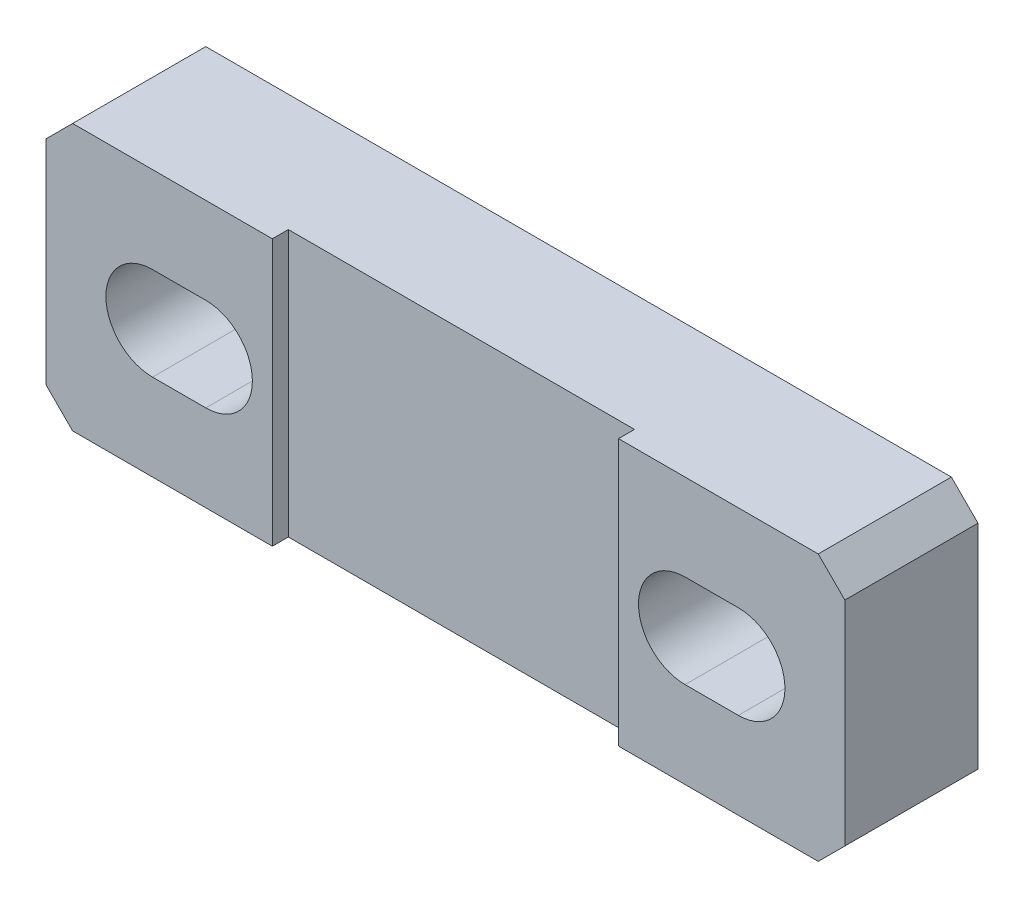
ISO-10303-21;
HEADER;
FILE_DESCRIPTION(('STEP AP214'),'2;1');
FILE_NAME('part.step','',(''),(''),'','','');
FILE_SCHEMA(('AUTOMOTIVE_DESIGN { 1 0 10303 214 1 1 1 1 }'));
ENDSEC;
DATA;
#1=APPLICATION_CONTEXT('core data for automotive mechanical design processes');
#2=APPLICATION_PROTOCOL_DEFINITION('international standard','automotive_design',2000,#1);
#3=PRODUCT_CONTEXT('',#1,'mechanical');
#4=PRODUCT('Part','Part','',(#3));
#5=PRODUCT_RELATED_PRODUCT_CATEGORY('part','',(#4));
#6=PRODUCT_DEFINITION_FORMATION('','',#4);
#7=PRODUCT_DEFINITION_CONTEXT('part definition',#1,'design');
#8=PRODUCT_DEFINITION('design','',#6,#7);
#9=PRODUCT_DEFINITION_SHAPE('','',#8);
#10=(LENGTH_UNIT() NAMED_UNIT(*) SI_UNIT(.MILLI.,.METRE.));
#11=(NAMED_UNIT(*) PLANE_ANGLE_UNIT() SI_UNIT($,.RADIAN.));
#12=(NAMED_UNIT(*) SI_UNIT($,.STERADIAN.) SOLID_ANGLE_UNIT());
#13=UNCERTAINTY_MEASURE_WITH_UNIT(LENGTH_MEASURE(1.E-05),#10,'distance_accuracy_value','');
#14=(GEOMETRIC_REPRESENTATION_CONTEXT(3) GLOBAL_UNCERTAINTY_ASSIGNED_CONTEXT((#13)) GLOBAL_UNIT_ASSIGNED_CONTEXT((#10,
#11,#12)) REPRESENTATION_CONTEXT('',''));
#15=CARTESIAN_POINT('',(0.,0.,0.));
#16=DIRECTION('',(0.,0.,1.));
#17=DIRECTION('',(1.,0.,0.));
#18=AXIS2_PLACEMENT_3D('',#15,#16,#17);
#19=CARTESIAN_POINT('',(0.,0.,0.));
#20=DIRECTION('',(0.,0.,1.));
#21=DIRECTION('',(1.,0.,0.));
#22=AXIS2_PLACEMENT_3D('',#19,#20,#21);
#23=PLANE('',#22);
#24=DIRECTION('',(0.,-1.,0.));
#25=VECTOR('',#24,1.);
#26=CARTESIAN_POINT('',(-15.,-5.,0.));
#27=LINE('',#26,#25);
#28=CARTESIAN_POINT('',(-15.,3.99999999999999,0.));
#29=VERTEX_POINT('',#28);
#30=CARTESIAN_POINT('',(-15.,-4.,0.));
#31=VERTEX_POINT('',#30);
#32=EDGE_CURVE('E254',#29,#31,#27,.T.);
#33=ORIENTED_EDGE('',*,*,#32,.T.);
#34=DIRECTION('',(-0.707106781186548,0.707106781186548,0.));
#35=VECTOR('',#34,1.);
#36=CARTESIAN_POINT('',(-9.5,-9.5,0.));
#37=LINE('',#36,#35);
#38=CARTESIAN_POINT('',(-14.,-5.,0.));
#39=VERTEX_POINT('',#38);
#40=EDGE_CURVE('E12',#31,#39,#37,.F.);
#41=ORIENTED_EDGE('',*,*,#40,.T.);
#42=DIRECTION('',(1.,0.,0.));
#43=VECTOR('',#42,1.);
#44=CARTESIAN_POINT('',(15.,-5.,0.));
#45=LINE('',#44,#43);
#46=CARTESIAN_POINT('',(-6.5,-5.,0.));
#47=VERTEX_POINT('',#46);
#48=EDGE_CURVE('E258',#39,#47,#45,.T.);
#49=ORIENTED_EDGE('',*,*,#48,.T.);
#50=DIRECTION('',(0.,-1.,0.));
#51=VECTOR('',#50,1.);
#52=CARTESIAN_POINT('',(-6.5,-5.,0.));
#53=LINE('',#52,#51);
#54=CARTESIAN_POINT('',(-6.5,5.,0.));
#55=VERTEX_POINT('',#54);
#56=EDGE_CURVE('E179',#55,#47,#53,.T.);
#57=ORIENTED_EDGE('',*,*,#56,.F.);
#58=DIRECTION('',(-1.,0.,0.));
#59=VECTOR('',#58,1.);
#60=CARTESIAN_POINT('',(15.,5.,0.));
#61=LINE('',#60,#59);
#62=CARTESIAN_POINT('',(-14.,4.99999999999999,0.));
#63=VERTEX_POINT('',#62);
#64=EDGE_CURVE('E263',#55,#63,#61,.T.);
#65=ORIENTED_EDGE('',*,*,#64,.T.);
#66=DIRECTION('',(0.707106781186544,0.707106781186551,0.));
#67=VECTOR('',#66,1.);
#68=CARTESIAN_POINT('',(-9.50000000000006,9.49999999999998,0.));
#69=LINE('',#68,#67);
#70=EDGE_CURVE('E45',#63,#29,#69,.F.);
#71=ORIENTED_EDGE('',*,*,#70,.T.);
#72=EDGE_LOOP('',(#33,#41,#49,#57,#65,#71));
#73=FACE_BOUND('',#72,.T.);
#74=CARTESIAN_POINT('',(-9.,0.,0.));
#75=DIRECTION('',(0.,0.,1.));
#76=DIRECTION('',(1.,0.,0.));
#77=AXIS2_PLACEMENT_3D('',#74,#75,#76);
#78=CIRCLE('',#77,1.75);
#79=CARTESIAN_POINT('',(-9.,-1.75,0.));
#80=VERTEX_POINT('',#79);
#81=CARTESIAN_POINT('',(-9.,1.75,0.));
#82=VERTEX_POINT('',#81);
#83=EDGE_CURVE('E427',#80,#82,#78,.T.);
#84=ORIENTED_EDGE('',*,*,#83,.F.);
#85=DIRECTION('',(1.,0.,0.));
#86=VECTOR('',#85,1.);
#87=CARTESIAN_POINT('',(-9.,-1.75,0.));
#88=LINE('',#87,#86);
#89=CARTESIAN_POINT('',(-11.,-1.75,0.));
#90=VERTEX_POINT('',#89);
#91=EDGE_CURVE('E417',#90,#80,#88,.T.);
#92=ORIENTED_EDGE('',*,*,#91,.F.);
#93=CARTESIAN_POINT('',(-11.,0.,0.));
#94=DIRECTION('',(0.,0.,1.));
#95=DIRECTION('',(1.,0.,0.));
#96=AXIS2_PLACEMENT_3D('',#93,#94,#95);
#97=CIRCLE('',#96,1.75);
#98=CARTESIAN_POINT('',(-11.,1.75,0.));
#99=VERTEX_POINT('',#98);
#100=EDGE_CURVE('E442',#99,#90,#97,.T.);
#101=ORIENTED_EDGE('',*,*,#100,.F.);
#102=DIRECTION('',(-1.,0.,0.));
#103=VECTOR('',#102,1.);
#104=CARTESIAN_POINT('',(-9.,1.75,0.));
#105=LINE('',#104,#103);
#106=EDGE_CURVE('E430',#82,#99,#105,.T.);
#107=ORIENTED_EDGE('',*,*,#106,.F.);
#108=EDGE_LOOP('',(#84,#92,#101,#107));
#109=FACE_BOUND('',#108,.T.);
#110=ADVANCED_FACE('F37',(#73,#109),#23,.T.);
#111=CARTESIAN_POINT('',(-15.,-5.,-5.));
#112=DIRECTION('',(-1.,0.,0.));
#113=DIRECTION('',(0.,0.,1.));
#114=AXIS2_PLACEMENT_3D('',#111,#112,#113);
#115=PLANE('',#114);
#116=DIRECTION('',(0.,-1.,0.));
#117=VECTOR('',#116,1.);
#118=CARTESIAN_POINT('',(-15.,-5.,-5.));
#119=LINE('',#118,#117);
#120=CARTESIAN_POINT('',(-15.,3.99999999999999,-5.));
#121=VERTEX_POINT('',#120);
#122=CARTESIAN_POINT('',(-15.,-4.,-5.));
#123=VERTEX_POINT('',#122);
#124=EDGE_CURVE('E243',#121,#123,#119,.T.);
#125=ORIENTED_EDGE('',*,*,#124,.T.);
#126=DIRECTION('',(0.,0.,1.));
#127=VECTOR('',#126,1.);
#128=CARTESIAN_POINT('',(-15.,-4.,-5.));
#129=LINE('',#128,#127);
#130=EDGE_CURVE('E294',#123,#31,#129,.T.);
#131=ORIENTED_EDGE('',*,*,#130,.T.);
#132=ORIENTED_EDGE('',*,*,#32,.F.);
#133=DIRECTION('',(0.,0.,-1.));
#134=VECTOR('',#133,1.);
#135=CARTESIAN_POINT('',(-15.,3.99999999999999,-5.));
#136=LINE('',#135,#134);
#137=EDGE_CURVE('E292',#29,#121,#136,.T.);
#138=ORIENTED_EDGE('',*,*,#137,.T.);
#139=EDGE_LOOP('',(#125,#131,#132,#138));
#140=FACE_BOUND('',#139,.T.);
#141=ADVANCED_FACE('F297',(#140),#115,.T.);
#142=CARTESIAN_POINT('',(15.,5.,-5.));
#143=DIRECTION('',(0.,1.,0.));
#144=DIRECTION('',(-1.,0.,0.));
#145=AXIS2_PLACEMENT_3D('',#142,#143,#144);
#146=PLANE('',#145);
#147=CARTESIAN_POINT('',(14.,5.,0.));
#148=VERTEX_POINT('',#147);
#149=CARTESIAN_POINT('',(6.5,5.,0.));
#150=VERTEX_POINT('',#149);
#151=EDGE_CURVE('E264',#148,#150,#61,.T.);
#152=ORIENTED_EDGE('',*,*,#151,.F.);
#153=DIRECTION('',(0.,0.,-1.));
#154=VECTOR('',#153,1.);
#155=CARTESIAN_POINT('',(14.,5.,-5.));
#156=LINE('',#155,#154);
#157=CARTESIAN_POINT('',(14.,5.,-5.));
#158=VERTEX_POINT('',#157);
#159=EDGE_CURVE('E290',#148,#158,#156,.T.);
#160=ORIENTED_EDGE('',*,*,#159,.T.);
#161=DIRECTION('',(-1.,0.,0.));
#162=VECTOR('',#161,1.);
#163=CARTESIAN_POINT('',(15.,5.,-5.));
#164=LINE('',#163,#162);
#165=CARTESIAN_POINT('',(-14.,5.,-5.));
#166=VERTEX_POINT('',#165);
#167=EDGE_CURVE('E249',#158,#166,#164,.T.);
#168=ORIENTED_EDGE('',*,*,#167,.T.);
#169=DIRECTION('',(0.,0.,1.));
#170=VECTOR('',#169,1.);
#171=CARTESIAN_POINT('',(-14.,5.,-5.));
#172=LINE('',#171,#170);
#173=EDGE_CURVE('E287',#166,#63,#172,.T.);
#174=ORIENTED_EDGE('',*,*,#173,.T.);
#175=ORIENTED_EDGE('',*,*,#64,.F.);
#176=DIRECTION('',(0.,0.,1.));
#177=VECTOR('',#176,1.);
#178=CARTESIAN_POINT('',(-6.5,5.,-0.6));
#179=LINE('',#178,#177);
#180=CARTESIAN_POINT('',(-6.5,5.,-0.6));
#181=VERTEX_POINT('',#180);
#182=EDGE_CURVE('E207',#181,#55,#179,.T.);
#183=ORIENTED_EDGE('',*,*,#182,.F.);
#184=DIRECTION('',(-1.,0.,0.));
#185=VECTOR('',#184,1.);
#186=CARTESIAN_POINT('',(6.5,5.,-0.6));
#187=LINE('',#186,#185);
#188=CARTESIAN_POINT('',(6.5,5.,-0.6));
#189=VERTEX_POINT('',#188);
#190=EDGE_CURVE('E184',#189,#181,#187,.T.);
#191=ORIENTED_EDGE('',*,*,#190,.F.);
#192=DIRECTION('',(0.,0.,1.));
#193=VECTOR('',#192,1.);
#194=CARTESIAN_POINT('',(6.5,5.,-0.6));
#195=LINE('',#194,#193);
#196=EDGE_CURVE('E210',#189,#150,#195,.T.);
#197=ORIENTED_EDGE('',*,*,#196,.T.);
#198=EDGE_LOOP('',(#152,#160,#168,#174,#175,#183,#191,#197));
#199=FACE_BOUND('',#198,.T.);
#200=ADVANCED_FACE('F328',(#199),#146,.T.);
#201=CARTESIAN_POINT('',(15.,-5.,-5.));
#202=DIRECTION('',(1.,0.,0.));
#203=DIRECTION('',(0.,0.,-1.));
#204=AXIS2_PLACEMENT_3D('',#201,#202,#203);
#205=PLANE('',#204);
#206=DIRECTION('',(0.,1.,0.));
#207=VECTOR('',#206,1.);
#208=CARTESIAN_POINT('',(15.,-5.,0.));
#209=LINE('',#208,#207);
#210=CARTESIAN_POINT('',(15.,-4.,0.));
#211=VERTEX_POINT('',#210);
#212=CARTESIAN_POINT('',(15.,3.99999999999999,0.));
#213=VERTEX_POINT('',#212);
#214=EDGE_CURVE('E260',#211,#213,#209,.T.);
#215=ORIENTED_EDGE('',*,*,#214,.F.);
#216=DIRECTION('',(0.,0.,-1.));
#217=VECTOR('',#216,1.);
#218=CARTESIAN_POINT('',(15.,-4.,-5.));
#219=LINE('',#218,#217);
#220=CARTESIAN_POINT('',(15.,-4.,-5.));
#221=VERTEX_POINT('',#220);
#222=EDGE_CURVE('E277',#211,#221,#219,.T.);
#223=ORIENTED_EDGE('',*,*,#222,.T.);
#224=DIRECTION('',(0.,1.,0.));
#225=VECTOR('',#224,1.);
#226=CARTESIAN_POINT('',(15.,-5.,-5.));
#227=LINE('',#226,#225);
#228=CARTESIAN_POINT('',(15.,4.,-5.));
#229=VERTEX_POINT('',#228);
#230=EDGE_CURVE('E242',#221,#229,#227,.T.);
#231=ORIENTED_EDGE('',*,*,#230,.T.);
#232=DIRECTION('',(0.,0.,1.));
#233=VECTOR('',#232,1.);
#234=CARTESIAN_POINT('',(15.,4.,-5.));
#235=LINE('',#234,#233);
#236=EDGE_CURVE('E274',#229,#213,#235,.T.);
#237=ORIENTED_EDGE('',*,*,#236,.T.);
#238=EDGE_LOOP('',(#215,#223,#231,#237));
#239=FACE_BOUND('',#238,.T.);
#240=ADVANCED_FACE('F320',(#239),#205,.T.);
#241=CARTESIAN_POINT('',(15.,-5.,-5.));
#242=DIRECTION('',(0.,-1.,0.));
#243=DIRECTION('',(1.,0.,0.));
#244=AXIS2_PLACEMENT_3D('',#241,#242,#243);
#245=PLANE('',#244);
#246=DIRECTION('',(1.,0.,0.));
#247=VECTOR('',#246,1.);
#248=CARTESIAN_POINT('',(15.,-5.,-5.));
#249=LINE('',#248,#247);
#250=CARTESIAN_POINT('',(-14.,-5.00000000000001,-5.));
#251=VERTEX_POINT('',#250);
#252=CARTESIAN_POINT('',(14.,-5.,-5.));
#253=VERTEX_POINT('',#252);
#254=EDGE_CURVE('E240',#251,#253,#249,.T.);
#255=ORIENTED_EDGE('',*,*,#254,.T.);
#256=DIRECTION('',(0.,0.,1.));
#257=VECTOR('',#256,1.);
#258=CARTESIAN_POINT('',(14.,-5.,-5.));
#259=LINE('',#258,#257);
#260=CARTESIAN_POINT('',(14.,-5.,0.));
#261=VERTEX_POINT('',#260);
#262=EDGE_CURVE('E267',#253,#261,#259,.T.);
#263=ORIENTED_EDGE('',*,*,#262,.T.);
#264=CARTESIAN_POINT('',(6.5,-5.,0.));
#265=VERTEX_POINT('',#264);
#266=EDGE_CURVE('E256',#265,#261,#45,.T.);
#267=ORIENTED_EDGE('',*,*,#266,.F.);
#268=DIRECTION('',(0.,0.,1.));
#269=VECTOR('',#268,1.);
#270=CARTESIAN_POINT('',(6.5,-5.,-0.6));
#271=LINE('',#270,#269);
#272=CARTESIAN_POINT('',(6.5,-5.,-0.6));
#273=VERTEX_POINT('',#272);
#274=EDGE_CURVE('E183',#273,#265,#271,.T.);
#275=ORIENTED_EDGE('',*,*,#274,.F.);
#276=DIRECTION('',(1.,0.,0.));
#277=VECTOR('',#276,1.);
#278=CARTESIAN_POINT('',(6.5,-5.,-0.6));
#279=LINE('',#278,#277);
#280=CARTESIAN_POINT('',(-6.5,-5.,-0.6));
#281=VERTEX_POINT('',#280);
#282=EDGE_CURVE('E190',#281,#273,#279,.T.);
#283=ORIENTED_EDGE('',*,*,#282,.F.);
#284=DIRECTION('',(0.,0.,1.));
#285=VECTOR('',#284,1.);
#286=CARTESIAN_POINT('',(-6.5,-5.,-0.6));
#287=LINE('',#286,#285);
#288=EDGE_CURVE('E173',#281,#47,#287,.T.);
#289=ORIENTED_EDGE('',*,*,#288,.T.);
#290=ORIENTED_EDGE('',*,*,#48,.F.);
#291=DIRECTION('',(0.,0.,-1.));
#292=VECTOR('',#291,1.);
#293=CARTESIAN_POINT('',(-14.,-5.,-5.));
#294=LINE('',#293,#292);
#295=EDGE_CURVE('E253',#39,#251,#294,.T.);
#296=ORIENTED_EDGE('',*,*,#295,.T.);
#297=EDGE_LOOP('',(#255,#263,#267,#275,#283,#289,#290,#296));
#298=FACE_BOUND('',#297,.T.);
#299=ADVANCED_FACE('F197',(#298),#245,.T.);
#300=CARTESIAN_POINT('',(0.,0.,-5.));
#301=DIRECTION('',(0.,0.,1.));
#302=DIRECTION('',(1.,0.,0.));
#303=AXIS2_PLACEMENT_3D('',#300,#301,#302);
#304=PLANE('',#303);
#305=DIRECTION('',(-1.,0.,0.));
#306=VECTOR('',#305,1.);
#307=CARTESIAN_POINT('',(9.,1.74999999999999,-5.));
#308=LINE('',#307,#306);
#309=CARTESIAN_POINT('',(11.,1.74999999999999,-5.));
#310=VERTEX_POINT('',#309);
#311=CARTESIAN_POINT('',(9.,1.74999999999999,-5.));
#312=VERTEX_POINT('',#311);
#313=EDGE_CURVE('E224',#310,#312,#308,.T.);
#314=ORIENTED_EDGE('',*,*,#313,.T.);
#315=CARTESIAN_POINT('',(9.,0.,-5.));
#316=DIRECTION('',(0.,0.,1.));
#317=DIRECTION('',(-1.,0.,0.));
#318=AXIS2_PLACEMENT_3D('',#315,#316,#317);
#319=CIRCLE('',#318,1.75);
#320=CARTESIAN_POINT('',(9.,-1.75000000000001,-5.));
#321=VERTEX_POINT('',#320);
#322=EDGE_CURVE('E214',#312,#321,#319,.T.);
#323=ORIENTED_EDGE('',*,*,#322,.T.);
#324=DIRECTION('',(1.,0.,0.));
#325=VECTOR('',#324,1.);
#326=CARTESIAN_POINT('',(9.,-1.75000000000001,-5.));
#327=LINE('',#326,#325);
#328=CARTESIAN_POINT('',(11.,-1.75000000000001,-5.));
#329=VERTEX_POINT('',#328);
#330=EDGE_CURVE('E217',#321,#329,#327,.T.);
#331=ORIENTED_EDGE('',*,*,#330,.T.);
#332=CARTESIAN_POINT('',(11.,0.,-5.));
#333=DIRECTION('',(0.,0.,1.));
#334=DIRECTION('',(-1.,0.,0.));
#335=AXIS2_PLACEMENT_3D('',#332,#333,#334);
#336=CIRCLE('',#335,1.75);
#337=EDGE_CURVE('E221',#329,#310,#336,.T.);
#338=ORIENTED_EDGE('',*,*,#337,.T.);
#339=EDGE_LOOP('',(#314,#323,#331,#338));
#340=FACE_BOUND('',#339,.T.);
#341=DIRECTION('',(1.,0.,0.));
#342=VECTOR('',#341,1.);
#343=CARTESIAN_POINT('',(-9.,-1.75,-5.));
#344=LINE('',#343,#342);
#345=CARTESIAN_POINT('',(-11.,-1.75,-5.));
#346=VERTEX_POINT('',#345);
#347=CARTESIAN_POINT('',(-9.,-1.75,-5.));
#348=VERTEX_POINT('',#347);
#349=EDGE_CURVE('E423',#346,#348,#344,.T.);
#350=ORIENTED_EDGE('',*,*,#349,.T.);
#351=CARTESIAN_POINT('',(-9.,0.,-5.));
#352=DIRECTION('',(0.,0.,1.));
#353=DIRECTION('',(1.,0.,0.));
#354=AXIS2_PLACEMENT_3D('',#351,#352,#353);
#355=CIRCLE('',#354,1.75);
#356=CARTESIAN_POINT('',(-9.,1.75,-5.));
#357=VERTEX_POINT('',#356);
#358=EDGE_CURVE('E413',#348,#357,#355,.T.);
#359=ORIENTED_EDGE('',*,*,#358,.T.);
#360=DIRECTION('',(-1.,0.,0.));
#361=VECTOR('',#360,1.);
#362=CARTESIAN_POINT('',(-9.,1.75,-5.));
#363=LINE('',#362,#361);
#364=CARTESIAN_POINT('',(-11.,1.75,-5.));
#365=VERTEX_POINT('',#364);
#366=EDGE_CURVE('E416',#357,#365,#363,.T.);
#367=ORIENTED_EDGE('',*,*,#366,.T.);
#368=CARTESIAN_POINT('',(-11.,0.,-5.));
#369=DIRECTION('',(0.,0.,1.));
#370=DIRECTION('',(1.,0.,0.));
#371=AXIS2_PLACEMENT_3D('',#368,#369,#370);
#372=CIRCLE('',#371,1.75);
#373=EDGE_CURVE('E420',#365,#346,#372,.T.);
#374=ORIENTED_EDGE('',*,*,#373,.T.);
#375=EDGE_LOOP('',(#350,#359,#367,#374));
#376=FACE_BOUND('',#375,.T.);
#377=ORIENTED_EDGE('',*,*,#230,.F.);
#378=DIRECTION('',(0.707106781186546,0.707106781186549,0.));
#379=VECTOR('',#378,1.);
#380=CARTESIAN_POINT('',(14.,-5.,-5.));
#381=LINE('',#380,#379);
#382=EDGE_CURVE('E285',#221,#253,#381,.F.);
#383=ORIENTED_EDGE('',*,*,#382,.T.);
#384=ORIENTED_EDGE('',*,*,#254,.F.);
#385=DIRECTION('',(0.707106781186548,-0.707106781186548,0.));
#386=VECTOR('',#385,1.);
#387=CARTESIAN_POINT('',(-15.,-4.,-5.));
#388=LINE('',#387,#386);
#389=EDGE_CURVE('E281',#251,#123,#388,.F.);
#390=ORIENTED_EDGE('',*,*,#389,.T.);
#391=ORIENTED_EDGE('',*,*,#124,.F.);
#392=DIRECTION('',(-0.707106781186544,-0.707106781186551,0.));
#393=VECTOR('',#392,1.);
#394=CARTESIAN_POINT('',(-14.,5.,-5.));
#395=LINE('',#394,#393);
#396=EDGE_CURVE('E279',#121,#166,#395,.F.);
#397=ORIENTED_EDGE('',*,*,#396,.T.);
#398=ORIENTED_EDGE('',*,*,#167,.F.);
#399=DIRECTION('',(-0.707106781186548,0.707106781186548,0.));
#400=VECTOR('',#399,1.);
#401=CARTESIAN_POINT('',(15.,4.,-5.));
#402=LINE('',#401,#400);
#403=EDGE_CURVE('E283',#158,#229,#402,.F.);
#404=ORIENTED_EDGE('',*,*,#403,.T.);
#405=EDGE_LOOP('',(#377,#383,#384,#390,#391,#397,#398,#404));
#406=FACE_BOUND('',#405,.T.);
#407=ADVANCED_FACE('F306',(#340,#376,#406),#304,.F.);
#408=ORIENTED_EDGE('',*,*,#266,.T.);
#409=DIRECTION('',(-0.707106781186546,-0.707106781186549,0.));
#410=VECTOR('',#409,1.);
#411=CARTESIAN_POINT('',(9.50000000000003,-9.5,0.));
#412=LINE('',#411,#410);
#413=EDGE_CURVE('E272',#261,#211,#412,.F.);
#414=ORIENTED_EDGE('',*,*,#413,.T.);
#415=ORIENTED_EDGE('',*,*,#214,.T.);
#416=DIRECTION('',(0.707106781186548,-0.707106781186548,0.));
#417=VECTOR('',#416,1.);
#418=CARTESIAN_POINT('',(9.5,9.5,0.));
#419=LINE('',#418,#417);
#420=EDGE_CURVE('E270',#213,#148,#419,.F.);
#421=ORIENTED_EDGE('',*,*,#420,.T.);
#422=ORIENTED_EDGE('',*,*,#151,.T.);
#423=DIRECTION('',(0.,1.,0.));
#424=VECTOR('',#423,1.);
#425=CARTESIAN_POINT('',(6.5,-5.,0.));
#426=LINE('',#425,#424);
#427=EDGE_CURVE('E194',#265,#150,#426,.T.);
#428=ORIENTED_EDGE('',*,*,#427,.F.);
#429=EDGE_LOOP('',(#408,#414,#415,#421,#422,#428));
#430=FACE_BOUND('',#429,.T.);
#431=CARTESIAN_POINT('',(9.,0.,0.));
#432=DIRECTION('',(0.,0.,1.));
#433=DIRECTION('',(-1.,0.,0.));
#434=AXIS2_PLACEMENT_3D('',#431,#432,#433);
#435=CIRCLE('',#434,1.75);
#436=CARTESIAN_POINT('',(9.,1.74999999999999,0.));
#437=VERTEX_POINT('',#436);
#438=CARTESIAN_POINT('',(9.,-1.75000000000001,0.));
#439=VERTEX_POINT('',#438);
#440=EDGE_CURVE('E209',#437,#439,#435,.T.);
#441=ORIENTED_EDGE('',*,*,#440,.F.);
#442=DIRECTION('',(-1.,0.,0.));
#443=VECTOR('',#442,1.);
#444=CARTESIAN_POINT('',(9.,1.74999999999999,0.));
#445=LINE('',#444,#443);
#446=CARTESIAN_POINT('',(11.,1.74999999999999,0.));
#447=VERTEX_POINT('',#446);
#448=EDGE_CURVE('E218',#447,#437,#445,.T.);
#449=ORIENTED_EDGE('',*,*,#448,.F.);
#450=CARTESIAN_POINT('',(11.,0.,0.));
#451=DIRECTION('',(0.,0.,1.));
#452=DIRECTION('',(-1.,0.,0.));
#453=AXIS2_PLACEMENT_3D('',#450,#451,#452);
#454=CIRCLE('',#453,1.75);
#455=CARTESIAN_POINT('',(11.,-1.75000000000001,0.));
#456=VERTEX_POINT('',#455);
#457=EDGE_CURVE('E401',#456,#447,#454,.T.);
#458=ORIENTED_EDGE('',*,*,#457,.F.);
#459=DIRECTION('',(1.,0.,0.));
#460=VECTOR('',#459,1.);
#461=CARTESIAN_POINT('',(9.,-1.75000000000001,0.));
#462=LINE('',#461,#460);
#463=EDGE_CURVE('E230',#439,#456,#462,.T.);
#464=ORIENTED_EDGE('',*,*,#463,.F.);
#465=EDGE_LOOP('',(#441,#449,#458,#464));
#466=FACE_BOUND('',#465,.T.);
#467=ADVANCED_FACE('F316',(#430,#466),#23,.T.);
#468=CARTESIAN_POINT('',(-9.,0.,-5.));
#469=DIRECTION('',(0.,0.,1.));
#470=DIRECTION('',(1.,0.,0.));
#471=AXIS2_PLACEMENT_3D('',#468,#469,#470);
#472=CYLINDRICAL_SURFACE('',#471,1.75);
#473=ORIENTED_EDGE('',*,*,#83,.T.);
#474=DIRECTION('',(0.,0.,1.));
#475=VECTOR('',#474,1.);
#476=CARTESIAN_POINT('',(-9.,1.75,-5.));
#477=LINE('',#476,#475);
#478=EDGE_CURVE('E426',#357,#82,#477,.T.);
#479=ORIENTED_EDGE('',*,*,#478,.F.);
#480=ORIENTED_EDGE('',*,*,#358,.F.);
#481=DIRECTION('',(0.,0.,1.));
#482=VECTOR('',#481,1.);
#483=CARTESIAN_POINT('',(-9.,-1.75,-5.));
#484=LINE('',#483,#482);
#485=EDGE_CURVE('E257',#348,#80,#484,.T.);
#486=ORIENTED_EDGE('',*,*,#485,.T.);
#487=EDGE_LOOP('',(#473,#479,#480,#486));
#488=FACE_BOUND('',#487,.T.);
#489=ADVANCED_FACE('F350',(#488),#472,.F.);
#490=CARTESIAN_POINT('',(-9.,-1.75,-5.));
#491=DIRECTION('',(0.,-1.,0.));
#492=DIRECTION('',(1.,0.,0.));
#493=AXIS2_PLACEMENT_3D('',#490,#491,#492);
#494=PLANE('',#493);
#495=ORIENTED_EDGE('',*,*,#91,.T.);
#496=ORIENTED_EDGE('',*,*,#485,.F.);
#497=ORIENTED_EDGE('',*,*,#349,.F.);
#498=DIRECTION('',(0.,0.,1.));
#499=VECTOR('',#498,1.);
#500=CARTESIAN_POINT('',(-11.,-1.75,-5.));
#501=LINE('',#500,#499);
#502=EDGE_CURVE('E445',#346,#90,#501,.T.);
#503=ORIENTED_EDGE('',*,*,#502,.T.);
#504=EDGE_LOOP('',(#495,#496,#497,#503));
#505=FACE_BOUND('',#504,.T.);
#506=ADVANCED_FACE('F355',(#505),#494,.F.);
#507=CARTESIAN_POINT('',(-11.,0.,-5.));
#508=DIRECTION('',(0.,0.,1.));
#509=DIRECTION('',(1.,0.,0.));
#510=AXIS2_PLACEMENT_3D('',#507,#508,#509);
#511=CYLINDRICAL_SURFACE('',#510,1.75);
#512=ORIENTED_EDGE('',*,*,#100,.T.);
#513=ORIENTED_EDGE('',*,*,#502,.F.);
#514=ORIENTED_EDGE('',*,*,#373,.F.);
#515=DIRECTION('',(0.,0.,1.));
#516=VECTOR('',#515,1.);
#517=CARTESIAN_POINT('',(-11.,1.75,-5.));
#518=LINE('',#517,#516);
#519=EDGE_CURVE('E447',#365,#99,#518,.T.);
#520=ORIENTED_EDGE('',*,*,#519,.T.);
#521=EDGE_LOOP('',(#512,#513,#514,#520));
#522=FACE_BOUND('',#521,.T.);
#523=ADVANCED_FACE('F369',(#522),#511,.F.);
#524=CARTESIAN_POINT('',(-9.,1.75,-5.));
#525=DIRECTION('',(0.,1.,0.));
#526=DIRECTION('',(-1.,0.,0.));
#527=AXIS2_PLACEMENT_3D('',#524,#525,#526);
#528=PLANE('',#527);
#529=ORIENTED_EDGE('',*,*,#106,.T.);
#530=ORIENTED_EDGE('',*,*,#519,.F.);
#531=ORIENTED_EDGE('',*,*,#366,.F.);
#532=ORIENTED_EDGE('',*,*,#478,.T.);
#533=EDGE_LOOP('',(#529,#530,#531,#532));
#534=FACE_BOUND('',#533,.T.);
#535=ADVANCED_FACE('F365',(#534),#528,.F.);
#536=CARTESIAN_POINT('',(9.,0.,-5.));
#537=DIRECTION('',(0.,0.,1.));
#538=DIRECTION('',(1.,0.,0.));
#539=AXIS2_PLACEMENT_3D('',#536,#537,#538);
#540=CYLINDRICAL_SURFACE('',#539,1.75);
#541=ORIENTED_EDGE('',*,*,#440,.T.);
#542=DIRECTION('',(0.,0.,1.));
#543=VECTOR('',#542,1.);
#544=CARTESIAN_POINT('',(9.,-1.75000000000001,-5.));
#545=LINE('',#544,#543);
#546=EDGE_CURVE('E227',#321,#439,#545,.T.);
#547=ORIENTED_EDGE('',*,*,#546,.F.);
#548=ORIENTED_EDGE('',*,*,#322,.F.);
#549=DIRECTION('',(0.,0.,1.));
#550=VECTOR('',#549,1.);
#551=CARTESIAN_POINT('',(9.,1.74999999999999,-5.));
#552=LINE('',#551,#550);
#553=EDGE_CURVE('E396',#312,#437,#552,.T.);
#554=ORIENTED_EDGE('',*,*,#553,.T.);
#555=EDGE_LOOP('',(#541,#547,#548,#554));
#556=FACE_BOUND('',#555,.T.);
#557=ADVANCED_FACE('F368',(#556),#540,.F.);
#558=CARTESIAN_POINT('',(9.,1.74999999999999,-5.));
#559=DIRECTION('',(0.,1.,0.));
#560=DIRECTION('',(-1.,0.,0.));
#561=AXIS2_PLACEMENT_3D('',#558,#559,#560);
#562=PLANE('',#561);
#563=ORIENTED_EDGE('',*,*,#448,.T.);
#564=ORIENTED_EDGE('',*,*,#553,.F.);
#565=ORIENTED_EDGE('',*,*,#313,.F.);
#566=DIRECTION('',(0.,0.,1.));
#567=VECTOR('',#566,1.);
#568=CARTESIAN_POINT('',(11.,1.74999999999999,-5.));
#569=LINE('',#568,#567);
#570=EDGE_CURVE('E398',#310,#447,#569,.T.);
#571=ORIENTED_EDGE('',*,*,#570,.T.);
#572=EDGE_LOOP('',(#563,#564,#565,#571));
#573=FACE_BOUND('',#572,.T.);
#574=ADVANCED_FACE('F379',(#573),#562,.F.);
#575=CARTESIAN_POINT('',(11.,0.,-5.));
#576=DIRECTION('',(0.,0.,1.));
#577=DIRECTION('',(1.,0.,0.));
#578=AXIS2_PLACEMENT_3D('',#575,#576,#577);
#579=CYLINDRICAL_SURFACE('',#578,1.75);
#580=ORIENTED_EDGE('',*,*,#457,.T.);
#581=ORIENTED_EDGE('',*,*,#570,.F.);
#582=ORIENTED_EDGE('',*,*,#337,.F.);
#583=DIRECTION('',(0.,0.,1.));
#584=VECTOR('',#583,1.);
#585=CARTESIAN_POINT('',(11.,-1.75000000000001,-5.));
#586=LINE('',#585,#584);
#587=EDGE_CURVE('E408',#329,#456,#586,.T.);
#588=ORIENTED_EDGE('',*,*,#587,.T.);
#589=EDGE_LOOP('',(#580,#581,#582,#588));
#590=FACE_BOUND('',#589,.T.);
#591=ADVANCED_FACE('F383',(#590),#579,.F.);
#592=CARTESIAN_POINT('',(9.,-1.75000000000001,-5.));
#593=DIRECTION('',(0.,-1.,0.));
#594=DIRECTION('',(1.,0.,0.));
#595=AXIS2_PLACEMENT_3D('',#592,#593,#594);
#596=PLANE('',#595);
#597=ORIENTED_EDGE('',*,*,#463,.T.);
#598=ORIENTED_EDGE('',*,*,#587,.F.);
#599=ORIENTED_EDGE('',*,*,#330,.F.);
#600=ORIENTED_EDGE('',*,*,#546,.T.);
#601=EDGE_LOOP('',(#597,#598,#599,#600));
#602=FACE_BOUND('',#601,.T.);
#603=ADVANCED_FACE('F339',(#602),#596,.F.);
#604=CARTESIAN_POINT('',(-6.5,-5.,-0.6));
#605=DIRECTION('',(-1.,0.,0.));
#606=DIRECTION('',(0.,0.,1.));
#607=AXIS2_PLACEMENT_3D('',#604,#605,#606);
#608=PLANE('',#607);
#609=ORIENTED_EDGE('',*,*,#56,.T.);
#610=ORIENTED_EDGE('',*,*,#288,.F.);
#611=DIRECTION('',(0.,-1.,0.));
#612=VECTOR('',#611,1.);
#613=CARTESIAN_POINT('',(-6.5,-5.,-0.6));
#614=LINE('',#613,#612);
#615=EDGE_CURVE('E176',#181,#281,#614,.T.);
#616=ORIENTED_EDGE('',*,*,#615,.F.);
#617=ORIENTED_EDGE('',*,*,#182,.T.);
#618=EDGE_LOOP('',(#609,#610,#616,#617));
#619=FACE_BOUND('',#618,.T.);
#620=ADVANCED_FACE('F175',(#619),#608,.F.);
#621=CARTESIAN_POINT('',(6.5,-5.,-0.6));
#622=DIRECTION('',(1.,0.,0.));
#623=DIRECTION('',(0.,0.,-1.));
#624=AXIS2_PLACEMENT_3D('',#621,#622,#623);
#625=PLANE('',#624);
#626=ORIENTED_EDGE('',*,*,#427,.T.);
#627=ORIENTED_EDGE('',*,*,#196,.F.);
#628=DIRECTION('',(0.,1.,0.));
#629=VECTOR('',#628,1.);
#630=CARTESIAN_POINT('',(6.5,-5.,-0.6));
#631=LINE('',#630,#629);
#632=EDGE_CURVE('E199',#273,#189,#631,.T.);
#633=ORIENTED_EDGE('',*,*,#632,.F.);
#634=ORIENTED_EDGE('',*,*,#274,.T.);
#635=EDGE_LOOP('',(#626,#627,#633,#634));
#636=FACE_BOUND('',#635,.T.);
#637=ADVANCED_FACE('F331',(#636),#625,.F.);
#638=CARTESIAN_POINT('',(0.,0.,-0.6));
#639=DIRECTION('',(0.,0.,1.));
#640=DIRECTION('',(1.,0.,0.));
#641=AXIS2_PLACEMENT_3D('',#638,#639,#640);
#642=PLANE('',#641);
#643=ORIENTED_EDGE('',*,*,#615,.T.);
#644=ORIENTED_EDGE('',*,*,#282,.T.);
#645=ORIENTED_EDGE('',*,*,#632,.T.);
#646=ORIENTED_EDGE('',*,*,#190,.T.);
#647=EDGE_LOOP('',(#643,#644,#645,#646));
#648=FACE_BOUND('',#647,.T.);
#649=ADVANCED_FACE('F188',(#648),#642,.T.);
#650=CARTESIAN_POINT('',(14.,-5.,-5.));
#651=DIRECTION('',(-0.707106781186549,0.707106781186546,0.));
#652=DIRECTION('',(0.,0.,1.));
#653=AXIS2_PLACEMENT_3D('',#650,#651,#652);
#654=PLANE('',#653);
#655=ORIENTED_EDGE('',*,*,#382,.F.);
#656=ORIENTED_EDGE('',*,*,#222,.F.);
#657=ORIENTED_EDGE('',*,*,#413,.F.);
#658=ORIENTED_EDGE('',*,*,#262,.F.);
#659=EDGE_LOOP('',(#655,#656,#657,#658));
#660=FACE_BOUND('',#659,.T.);
#661=ADVANCED_FACE('F312',(#660),#654,.F.);
#662=CARTESIAN_POINT('',(15.,4.,-5.));
#663=DIRECTION('',(-0.707106781186547,-0.707106781186547,0.));
#664=DIRECTION('',(0.,0.,1.));
#665=AXIS2_PLACEMENT_3D('',#662,#663,#664);
#666=PLANE('',#665);
#667=ORIENTED_EDGE('',*,*,#403,.F.);
#668=ORIENTED_EDGE('',*,*,#159,.F.);
#669=ORIENTED_EDGE('',*,*,#420,.F.);
#670=ORIENTED_EDGE('',*,*,#236,.F.);
#671=EDGE_LOOP('',(#667,#668,#669,#670));
#672=FACE_BOUND('',#671,.T.);
#673=ADVANCED_FACE('F324',(#672),#666,.F.);
#674=CARTESIAN_POINT('',(-15.,-4.,-5.));
#675=DIRECTION('',(0.707106781186547,0.707106781186547,0.));
#676=DIRECTION('',(0.,0.,1.));
#677=AXIS2_PLACEMENT_3D('',#674,#675,#676);
#678=PLANE('',#677);
#679=ORIENTED_EDGE('',*,*,#389,.F.);
#680=ORIENTED_EDGE('',*,*,#295,.F.);
#681=ORIENTED_EDGE('',*,*,#40,.F.);
#682=ORIENTED_EDGE('',*,*,#130,.F.);
#683=EDGE_LOOP('',(#679,#680,#681,#682));
#684=FACE_BOUND('',#683,.T.);
#685=ADVANCED_FACE('F303',(#684),#678,.F.);
#686=CARTESIAN_POINT('',(-14.,5.,-5.));
#687=DIRECTION('',(0.70710678118655,-0.707106781186544,0.));
#688=DIRECTION('',(0.,0.,1.));
#689=AXIS2_PLACEMENT_3D('',#686,#687,#688);
#690=PLANE('',#689);
#691=ORIENTED_EDGE('',*,*,#396,.F.);
#692=ORIENTED_EDGE('',*,*,#137,.F.);
#693=ORIENTED_EDGE('',*,*,#70,.F.);
#694=ORIENTED_EDGE('',*,*,#173,.F.);
#695=EDGE_LOOP('',(#691,#692,#693,#694));
#696=FACE_BOUND('',#695,.T.);
#697=ADVANCED_FACE('F39',(#696),#690,.F.);
#698=CLOSED_SHELL('',(#110,#141,#200,#240,#299,#407,#467,#489,#506,#523,#535,#557,#574,#591,
#603,#620,#637,#649,#661,#673,#685,#697));
#699=MANIFOLD_SOLID_BREP('B2',#698);
#700=ADVANCED_BREP_SHAPE_REPRESENTATION('',(#18,#699),#14);
#701=SHAPE_DEFINITION_REPRESENTATION(#9,#700);
ENDSEC;
END-ISO-10303-21;
